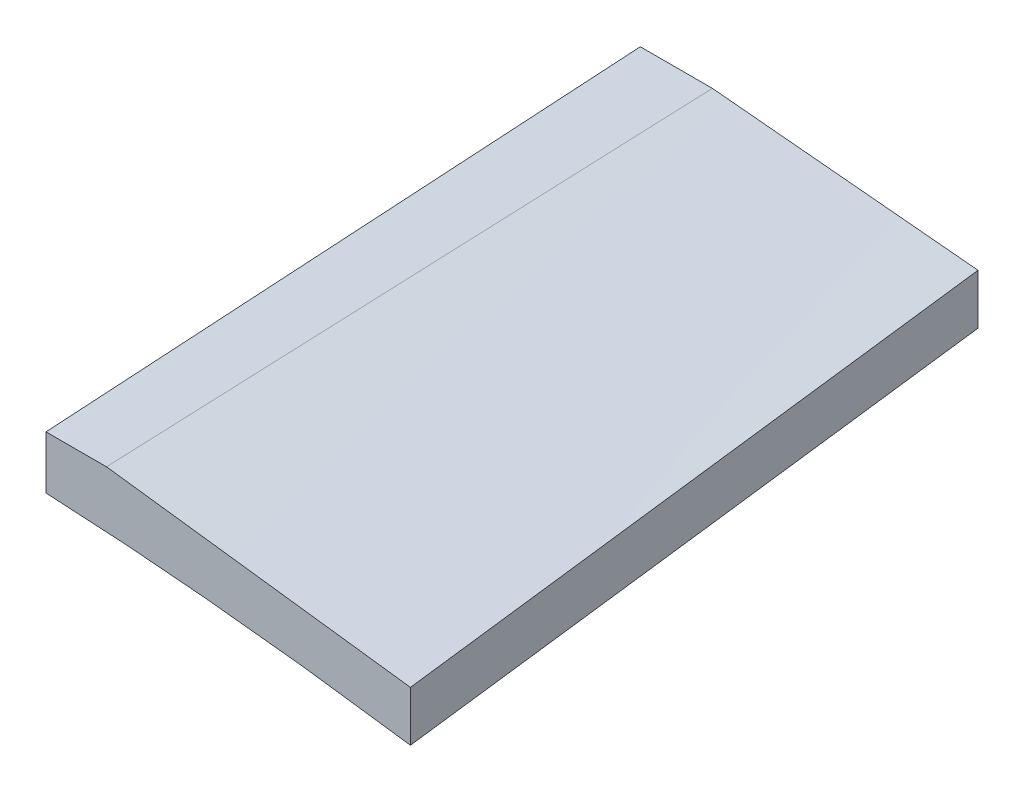
ISO-10303-21;
HEADER;
FILE_DESCRIPTION(('STEP AP214'),'2;1');
FILE_NAME('part.step','',(''),(''),'','','');
FILE_SCHEMA(('AUTOMOTIVE_DESIGN { 1 0 10303 214 1 1 1 1 }'));
ENDSEC;
DATA;
#1=APPLICATION_CONTEXT('core data for automotive mechanical design processes');
#2=APPLICATION_PROTOCOL_DEFINITION('international standard','automotive_design',2000,#1);
#3=PRODUCT_CONTEXT('',#1,'mechanical');
#4=PRODUCT('Part','Part','',(#3));
#5=PRODUCT_RELATED_PRODUCT_CATEGORY('part','',(#4));
#6=PRODUCT_DEFINITION_FORMATION('','',#4);
#7=PRODUCT_DEFINITION_CONTEXT('part definition',#1,'design');
#8=PRODUCT_DEFINITION('design','',#6,#7);
#9=PRODUCT_DEFINITION_SHAPE('','',#8);
#10=(LENGTH_UNIT() NAMED_UNIT(*) SI_UNIT(.MILLI.,.METRE.));
#11=(NAMED_UNIT(*) PLANE_ANGLE_UNIT() SI_UNIT($,.RADIAN.));
#12=(NAMED_UNIT(*) SI_UNIT($,.STERADIAN.) SOLID_ANGLE_UNIT());
#13=UNCERTAINTY_MEASURE_WITH_UNIT(LENGTH_MEASURE(1.E-05),#10,'distance_accuracy_value','');
#14=(GEOMETRIC_REPRESENTATION_CONTEXT(3) GLOBAL_UNCERTAINTY_ASSIGNED_CONTEXT((#13)) GLOBAL_UNIT_ASSIGNED_CONTEXT((#10,
#11,#12)) REPRESENTATION_CONTEXT('',''));
#15=CARTESIAN_POINT('',(0.,0.,0.));
#16=DIRECTION('',(0.,0.,1.));
#17=DIRECTION('',(1.,0.,0.));
#18=AXIS2_PLACEMENT_3D('',#15,#16,#17);
#19=CARTESIAN_POINT('',(122.012987748225,6.34998004884586,335.28));
#20=DIRECTION('',(1.,0.,0.));
#21=DIRECTION('',(0.,0.,-1.));
#22=AXIS2_PLACEMENT_3D('',#19,#20,#21);
#23=PLANE('',#22);
#24=CARTESIAN_POINT('',(122.012987753095,51.5903413603549,-91.4399999999999));
#25=CARTESIAN_POINT('',(122.012987749983,50.8127379259849,-79.5867202725594));
#26=CARTESIAN_POINT('',(122.012987748698,50.0353507213693,-67.7334263605867));
#27=CARTESIAN_POINT('',(122.012987747751,48.4809910908885,-44.0268113543124));
#28=CARTESIAN_POINT('',(122.01298774809,47.7040186650228,-32.1734902600109));
#29=CARTESIAN_POINT('',(122.01298774836,46.1504709095576,-8.46682204949769));
#30=CARTESIAN_POINT('',(122.012987748293,45.3738955799581,3.38652506671391));
#31=CARTESIAN_POINT('',(122.012987748157,43.8211244635701,27.0932441723444));
#32=CARTESIAN_POINT('',(122.01298774809,43.0449286767821,38.9466161617634));
#33=CARTESIAN_POINT('',(122.012987748225,42.268913885554,50.7999999999811));
#34=B_SPLINE_CURVE_WITH_KNOTS('',3,(#24,#25,#26,#27,#28,#29,#30,#31,#32,#33),.UNSPECIFIED.,.F.,
.F.,(4,2,2,2,4),(0.,35.6362759891527,71.272551938302,106.908827886564,142.545103874829),.UNSPECIFIED.);
#35=CARTESIAN_POINT('',(122.012985594409,51.5902087951168,-91.4399999999998));
#36=VERTEX_POINT('',#35);
#37=CARTESIAN_POINT('',(122.012987748225,42.268913885554,50.7999999999811));
#38=VERTEX_POINT('',#37);
#39=EDGE_CURVE('E113',#36,#38,#34,.T.);
#40=ORIENTED_EDGE('',*,*,#39,.T.);
#41=DIRECTION('',(0.,-1.,0.));
#42=VECTOR('',#41,1.);
#43=CARTESIAN_POINT('',(122.012987748225,6.34998004884586,50.8));
#44=LINE('',#43,#42);
#45=CARTESIAN_POINT('',(122.012987748225,54.9460232350274,50.7999999999811));
#46=VERTEX_POINT('',#45);
#47=EDGE_CURVE('E11',#46,#38,#44,.T.);
#48=ORIENTED_EDGE('',*,*,#47,.F.);
#49=CARTESIAN_POINT('',(122.012987748225,54.9460232350274,50.7999999999811));
#50=CARTESIAN_POINT('',(122.012987748225,55.9635309786544,34.1644219579198));
#51=CARTESIAN_POINT('',(122.012987748225,56.9813776547402,17.5288646435544));
#52=CARTESIAN_POINT('',(122.012987748225,59.0177944365331,-15.742205681728));
#53=CARTESIAN_POINT('',(122.012987748225,60.0363645422391,-32.3777186926452));
#54=CARTESIAN_POINT('',(122.012987748225,61.9215601213804,-63.1554894115923));
#55=CARTESIAN_POINT('',(122.012987748225,62.7880789795608,-77.2977536500892));
#56=CARTESIAN_POINT('',(122.012987748225,63.6548897190744,-91.4399999999999));
#57=B_SPLINE_CURVE_WITH_KNOTS('',3,(#49,#50,#51,#52,#53,#54,#55,#56),.UNSPECIFIED.,.F.,.F.,(4,2,
2,4),(0.,50.0000000934898,100.000000114269,142.506357681987),.UNSPECIFIED.);
#58=CARTESIAN_POINT('',(122.012987748225,63.6548897190744,-91.4399999999999));
#59=VERTEX_POINT('',#58);
#60=EDGE_CURVE('E116',#46,#59,#57,.T.);
#61=ORIENTED_EDGE('',*,*,#60,.T.);
#62=DIRECTION('',(0.,-1.,0.));
#63=VECTOR('',#62,1.);
#64=CARTESIAN_POINT('',(122.012987748225,51.6460530017887,-91.4399999999997));
#65=LINE('',#64,#63);
#66=EDGE_CURVE('E97',#59,#36,#65,.T.);
#67=ORIENTED_EDGE('',*,*,#66,.T.);
#68=EDGE_LOOP('',(#40,#48,#61,#67));
#69=FACE_BOUND('',#68,.T.);
#70=ADVANCED_FACE('F44',(#69),#23,.F.);
#71=CARTESIAN_POINT('',(0.,0.,50.8));
#72=DIRECTION('',(0.,0.,1.));
#73=DIRECTION('',(1.,0.,0.));
#74=AXIS2_PLACEMENT_3D('',#71,#72,#73);
#75=PLANE('',#74);
#76=CARTESIAN_POINT('',(209.230847337821,33.595842069036,50.8));
#77=CARTESIAN_POINT('',(208.025152317248,33.7723759248858,50.8));
#78=CARTESIAN_POINT('',(206.819182070088,33.9470314127565,50.8));
#79=CARTESIAN_POINT('',(204.406689974741,34.2924957503762,50.8));
#80=CARTESIAN_POINT('',(203.200168126187,34.4633045975705,50.8));
#81=CARTESIAN_POINT('',(200.786941644819,34.800933980048,50.8));
#82=CARTESIAN_POINT('',(199.580237180211,34.96775571681,50.8));
#83=CARTESIAN_POINT('',(197.166282190393,35.2973933779907,50.8));
#84=CARTESIAN_POINT('',(195.959031665217,35.4602093026612,50.8));
#85=CARTESIAN_POINT('',(192.337081572201,35.9422966200058,50.8));
#86=CARTESIAN_POINT('',(189.921541429177,36.2552975464865,50.8));
#87=CARTESIAN_POINT('',(186.296741727862,36.7108181799761,50.8));
#88=CARTESIAN_POINT('',(185.088355361681,36.8603131262002,50.8));
#89=CARTESIAN_POINT('',(182.670991607541,37.1544442927972,50.8));
#90=CARTESIAN_POINT('',(181.462014219506,37.2990805125503,50.8));
#91=CARTESIAN_POINT('',(177.834561667416,37.7254694276855,50.8));
#92=CARTESIAN_POINT('',(175.415200716581,37.9997483867404,50.8));
#93=CARTESIAN_POINT('',(171.784534444878,38.3953343071575,50.8));
#94=CARTESIAN_POINT('',(170.574085315804,38.5245531442786,50.8));
#95=CARTESIAN_POINT('',(168.152642442773,38.7777946571532,50.8));
#96=CARTESIAN_POINT('',(166.941648698677,38.9018173315685,50.8));
#97=CARTESIAN_POINT('',(164.519107052186,39.1447933959834,50.8));
#98=CARTESIAN_POINT('',(163.307559130601,39.2637465944752,50.8));
#99=CARTESIAN_POINT('',(160.883987043973,39.4966955240975,50.8));
#100=CARTESIAN_POINT('',(159.671962879002,39.610691255984,50.8));
#101=CARTESIAN_POINT('',(157.247386626677,39.8338159130427,50.8));
#102=CARTESIAN_POINT('',(156.034834509922,39.9429445186548,50.8));
#103=CARTESIAN_POINT('',(153.609304179194,40.1563627089267,50.8));
#104=CARTESIAN_POINT('',(152.3963259651,40.2606522922155,50.8));
#105=CARTESIAN_POINT('',(149.969808215908,40.4644591741015,50.8));
#106=CARTESIAN_POINT('',(148.756268627971,40.5639758433482,50.8));
#107=CARTESIAN_POINT('',(146.328808573915,40.7582519561394,50.8));
#108=CARTESIAN_POINT('',(145.11488810786,40.8530114004872,50.8));
#109=CARTESIAN_POINT('',(142.686404635555,41.0372500866874,50.8));
#110=CARTESIAN_POINT('',(141.471841549765,41.1267282823664,50.8));
#111=CARTESIAN_POINT('',(139.042302119273,41.299899718021,50.8));
#112=CARTESIAN_POINT('',(137.827325774478,41.3835929566902,50.8));
#113=CARTESIAN_POINT('',(135.396606916646,41.5448240876751,50.8));
#114=CARTESIAN_POINT('',(134.180864283447,41.6223601715288,50.8));
#115=CARTESIAN_POINT('',(131.748974807422,41.7707957864617,50.8));
#116=CARTESIAN_POINT('',(130.532827965172,41.8416953269315,50.8));
#117=CARTESIAN_POINT('',(126.882756849898,42.0438117710736,50.8));
#118=CARTESIAN_POINT('',(124.448241517671,42.1643767634276,50.8));
#119=CARTESIAN_POINT('',(122.012987748225,42.2689138855527,50.8));
#120=B_SPLINE_CURVE_WITH_KNOTS('',3,(#76,#77,#78,#79,#80,#81,#82,#83,#84,#85,#86,#87,#88,#89,
#90,#91,#92,#93,#94,#95,#96,#97,#98,#99,#100,#101,#102,#103,#104,#105,#106,#107,#108,#109,#110,
#111,#112,#113,#114,#115,#116,#117,#118,#119),.UNSPECIFIED.,.F.,.F.,(4,2,2,2,2,2,2,2,2,2,2,2,2,
2,2,2,2,2,2,2,2,4),(0.,3.65564947430247,7.31130137646595,10.9658374266024,14.6203732469968,
21.9274999239574,25.5802872569879,29.2330750559892,36.5375458333369,40.1895173027451,
43.8414897125591,47.4935999595117,51.1457096494075,54.7980587732716,58.4504089319146,
62.1032393683011,65.7560691879163,69.4096201922626,73.0631720217723,76.7177930232235,
80.3724088533061,87.6847658975797),.UNSPECIFIED.);
#121=CARTESIAN_POINT('',(209.230847337816,33.5958420690438,50.7999999999074));
#122=VERTEX_POINT('',#121);
#123=EDGE_CURVE('E112',#122,#38,#120,.T.);
#124=ORIENTED_EDGE('',*,*,#123,.F.);
#125=DIRECTION('',(0.,-1.,0.));
#126=VECTOR('',#125,1.);
#127=CARTESIAN_POINT('',(209.230847335755,9.36643436036436,50.8));
#128=LINE('',#127,#126);
#129=CARTESIAN_POINT('',(209.230847337816,45.5958420690438,50.7999999999074));
#130=VERTEX_POINT('',#129);
#131=EDGE_CURVE('E128',#130,#122,#128,.T.);
#132=ORIENTED_EDGE('',*,*,#131,.F.);
#133=CARTESIAN_POINT('',(136.489886899315,54.9460232350262,50.8));
#134=CARTESIAN_POINT('',(144.13434655408,53.9633982840046,50.8));
#135=CARTESIAN_POINT('',(151.778806208844,52.980773332983,50.8));
#136=CARTESIAN_POINT('',(167.724529442644,50.9310973298072,50.8));
#137=CARTESIAN_POINT('',(176.025793021679,49.8640462776529,50.8));
#138=CARTESIAN_POINT('',(192.62832017975,47.7299441733444,50.8));
#139=CARTESIAN_POINT('',(200.929583758785,46.6628931211902,50.8));
#140=CARTESIAN_POINT('',(209.230847337821,45.5958420690359,50.8));
#141=B_SPLINE_CURVE_WITH_KNOTS('',3,(#133,#134,#135,#136,#137,#138,#139,#140),.UNSPECIFIED.,.F.,
.F.,(4,2,2,4),(0.,23.1220638540164,48.2307510878943,73.3394383217721),.UNSPECIFIED.);
#142=CARTESIAN_POINT('',(136.489886899315,54.9460232350262,50.8));
#143=VERTEX_POINT('',#142);
#144=EDGE_CURVE('E161',#143,#130,#141,.T.);
#145=ORIENTED_EDGE('',*,*,#144,.F.);
#146=DIRECTION('',(-1.,0.,0.));
#147=VECTOR('',#146,1.);
#148=CARTESIAN_POINT('',(111.489886899315,54.9460232350262,50.8));
#149=LINE('',#148,#147);
#150=EDGE_CURVE('E169',#46,#143,#149,.F.);
#151=ORIENTED_EDGE('',*,*,#150,.F.);
#152=ORIENTED_EDGE('',*,*,#47,.T.);
#153=EDGE_LOOP('',(#124,#132,#145,#151,#152));
#154=FACE_BOUND('',#153,.T.);
#155=ADVANCED_FACE('F170',(#154),#75,.T.);
#156=CARTESIAN_POINT('',(130.956058059283,37.574856415899,335.28));
#157=CARTESIAN_POINT('',(133.722938387168,46.2481983373047,193.03830052474));
#158=CARTESIAN_POINT('',(136.489876885067,54.9368025875343,50.7978960975484));
#159=CARTESIAN_POINT('',(139.256928095494,63.6548897190744,-91.4399999999999));
#160=CARTESIAN_POINT('',(126.789391392616,37.5748564158991,335.28));
#161=CARTESIAN_POINT('',(129.556271720501,46.2481983373047,193.03830052474));
#162=CARTESIAN_POINT('',(132.3232102184,54.9368025875343,50.7978960975483));
#163=CARTESIAN_POINT('',(135.090261428827,63.6548897190744,-91.44));
#164=CARTESIAN_POINT('',(118.456058059283,37.574856415899,335.28));
#165=CARTESIAN_POINT('',(121.222938387168,46.2481983373047,193.03830052474));
#166=CARTESIAN_POINT('',(123.989876885067,54.9368025875344,50.7978960975478));
#167=CARTESIAN_POINT('',(126.756928095494,63.6548897190745,-91.4400000000005));
#168=CARTESIAN_POINT('',(105.956058059283,37.5748564158991,335.28));
#169=CARTESIAN_POINT('',(108.722938387168,46.2481983373046,193.038300524741));
#170=CARTESIAN_POINT('',(111.489876885067,54.9368025875342,50.7978960975486));
#171=CARTESIAN_POINT('',(114.256928095494,63.6548897190743,-91.4399999999992));
#172=CARTESIAN_POINT('',(93.4560580592829,37.574856415899,335.28));
#173=CARTESIAN_POINT('',(96.222938387168,46.2481983373047,193.03830052474));
#174=CARTESIAN_POINT('',(98.989876885067,54.9368025875343,50.7978960975481));
#175=CARTESIAN_POINT('',(101.756928095494,63.6548897190744,-91.4400000000002));
#176=CARTESIAN_POINT('',(85.1227247259497,37.574856415899,335.28));
#177=CARTESIAN_POINT('',(87.8896050538347,46.2481983373046,193.03830052474));
#178=CARTESIAN_POINT('',(90.6565435517336,54.9368025875343,50.7978960975484));
#179=CARTESIAN_POINT('',(93.4235947621608,63.6548897190744,-91.4399999999999));
#180=CARTESIAN_POINT('',(80.956058059283,37.5748564158991,335.28));
#181=CARTESIAN_POINT('',(83.722938387168,46.2481983373047,193.03830052474));
#182=CARTESIAN_POINT('',(86.489876885067,54.9368025875343,50.7978960975484));
#183=CARTESIAN_POINT('',(89.2569280954942,63.6548897190744,-91.4399999999999));
#184=B_SPLINE_SURFACE_WITH_KNOTS('',3,3,((#156,#157,#158,#159),(#160,#161,#162,#163),(#164,#165,
#166,#167),(#168,#169,#170,#171),(#172,#173,#174,#175),(#176,#177,#178,#179),(#180,#181,#182,
#183)),.UNSPECIFIED.,.F.,.F.,.F.,(4,1,1,1,4),(4,4),(0.19667758886926,0.224376205647247,
0.252074822425234,0.279773439203221,0.307472055981208),(0.,1.),.UNSPECIFIED.);
#185=CARTESIAN_POINT('',(130.956058059283,37.574856415899,335.28));
#186=CARTESIAN_POINT('',(133.722938387168,46.2481983373047,193.03830052474));
#187=CARTESIAN_POINT('',(136.489876885067,54.9368025875343,50.7978960975484));
#188=CARTESIAN_POINT('',(139.256928095494,63.6548897190744,-91.4399999999999));
#189=B_SPLINE_CURVE_WITH_KNOTS('',3,(#185,#186,#187,#188),.UNSPECIFIED.,.F.,.F.,(4,4),(0.,1.),.UNSPECIFIED.);
#190=CARTESIAN_POINT('',(139.256928095494,63.6548897190744,-91.4399999999999));
#191=VERTEX_POINT('',#190);
#192=EDGE_CURVE('E125',#143,#191,#189,.T.);
#193=CARTESIAN_POINT('',(139.256928095494,63.6548897190744,-91.4399999999999));
#194=CARTESIAN_POINT('',(135.090261428827,63.6548897190744,-91.44));
#195=CARTESIAN_POINT('',(126.756928095494,63.6548897190745,-91.4400000000005));
#196=CARTESIAN_POINT('',(114.256928095494,63.6548897190743,-91.4399999999992));
#197=CARTESIAN_POINT('',(101.756928095494,63.6548897190744,-91.4400000000002));
#198=CARTESIAN_POINT('',(93.4235947621608,63.6548897190744,-91.4399999999999));
#199=CARTESIAN_POINT('',(89.2569280954942,63.6548897190744,-91.4399999999999));
#200=B_SPLINE_CURVE_WITH_KNOTS('',3,(#193,#194,#195,#196,#197,#198,#199),.UNSPECIFIED.,.F.,.F.,
(4,1,1,1,4),(0.19667758886926,0.224376205647247,0.252074822425234,0.279773439203221,
0.307472055981208),.UNSPECIFIED.);
#201=EDGE_CURVE('E102',#191,#59,#200,.T.);
#202=ORIENTED_EDGE('',*,*,#60,.F.);
#203=ORIENTED_EDGE('',*,*,#150,.T.);
#204=ORIENTED_EDGE('',*,*,#192,.T.);
#205=ORIENTED_EDGE('',*,*,#201,.T.);
#206=EDGE_LOOP('',(#202,#203,#204,#205));
#207=FACE_BOUND('',#206,.T.);
#208=ADVANCED_FACE('F123',(#207),#184,.F.);
#209=CARTESIAN_POINT('',(111.477492972876,51.6460530017887,-91.4399999999997));
#210=DIRECTION('',(0.,0.,-1.));
#211=DIRECTION('',(1.,0.,0.));
#212=AXIS2_PLACEMENT_3D('',#209,#210,#211);
#213=PLANE('',#212);
#214=ORIENTED_EDGE('',*,*,#66,.F.);
#215=ORIENTED_EDGE('',*,*,#201,.F.);
#216=CARTESIAN_POINT('',(202.839777129521,57.7338764691475,-91.4399999999999));
#217=CARTESIAN_POINT('',(197.541206376685,58.2272942399747,-91.4399999999999));
#218=CARTESIAN_POINT('',(186.944064871014,59.2141297816292,-91.4399999999996));
#219=CARTESIAN_POINT('',(171.048352612508,60.694383094111,-91.4400000000009));
#220=CARTESIAN_POINT('',(155.152640354001,62.1746364065926,-91.4399999999991));
#221=CARTESIAN_POINT('',(144.55549884833,63.1614719482472,-91.4399999999999));
#222=CARTESIAN_POINT('',(139.256928095494,63.6548897190744,-91.4399999999999));
#223=B_SPLINE_CURVE_WITH_KNOTS('',3,(#216,#217,#218,#219,#220,#221,#222),.UNSPECIFIED.,.F.,.F.,
(4,1,1,1,4),(0.0265906721068675,0.0691124012974655,0.111634130488064,0.154155859678662,
0.19667758886926),.UNSPECIFIED.);
#224=CARTESIAN_POINT('',(202.839777129521,57.7338764691475,-91.4399999999999));
#225=VERTEX_POINT('',#224);
#226=EDGE_CURVE('E127',#225,#191,#223,.T.);
#227=ORIENTED_EDGE('',*,*,#226,.F.);
#228=CARTESIAN_POINT('',(202.839777129521,45.7338764691475,-91.4399999999997));
#229=DIRECTION('',(0.,1.,0.));
#230=VECTOR('',#229,1.);
#231=LINE('',#228,#230);
#232=CARTESIAN_POINT('',(202.839777129521,45.7338764691475,-91.4399999999999));
#233=VERTEX_POINT('',#232);
#234=EDGE_CURVE('E230',#233,#225,#231,.T.);
#235=ORIENTED_EDGE('',*,*,#234,.F.);
#236=CARTESIAN_POINT('',(24.9991434170329,31.0964008470047,-91.4399999999999));
#237=CARTESIAN_POINT('',(24.9991434170329,31.9847454271249,-91.4399999999999));
#238=CARTESIAN_POINT('',(25.7503176768857,33.8050798804101,-91.4399999999995));
#239=CARTESIAN_POINT('',(27.639772216348,35.8005902171344,-91.4400000000005));
#240=CARTESIAN_POINT('',(29.1705173067003,36.9980207293825,-91.4399999999997));
#241=CARTESIAN_POINT('',(30.3450357013417,37.7638508164184,-91.4399999999995));
#242=CARTESIAN_POINT('',(31.5628825203461,38.4646841877197,-91.4400000000003));
#243=CARTESIAN_POINT('',(32.8194198795603,39.1326380892775,-91.4399999999985));
#244=CARTESIAN_POINT('',(34.1087660162101,39.76211537415,-91.4400000000019));
#245=CARTESIAN_POINT('',(35.423753443141,40.3575744912294,-91.4399999999986));
#246=CARTESIAN_POINT('',(36.7523273727916,40.9175522446957,-91.4399999999994));
#247=CARTESIAN_POINT('',(38.5365484496361,41.620439414076,-91.4400000000014));
#248=CARTESIAN_POINT('',(40.7808179288063,42.4236899026778,-91.4399999999981));
#249=CARTESIAN_POINT('',(43.4998863356233,43.3024834322195,-91.4400000000012));
#250=CARTESIAN_POINT('',(46.2422110430595,44.1243377503001,-91.4399999999992));
#251=CARTESIAN_POINT('',(49.0044552878221,44.8839503138367,-91.4399999999999));
#252=CARTESIAN_POINT('',(51.7823749144814,45.579852219273,-91.4400000000001));
#253=CARTESIAN_POINT('',(54.5738920306224,46.2168613574358,-91.4399999999994));
#254=CARTESIAN_POINT('',(57.3771248806601,46.8012725525181,-91.4400000000006));
#255=CARTESIAN_POINT('',(60.1895182985876,47.3383437533655,-91.4399999999989));
#256=CARTESIAN_POINT('',(63.009968933455,47.8345333447187,-91.4400000000012));
#257=CARTESIAN_POINT('',(66.7768063122753,48.4457345663082,-91.4399999999991));
#258=CARTESIAN_POINT('',(71.5024082401206,49.1196825782396,-91.4400000000007));
#259=CARTESIAN_POINT('',(77.1867296544622,49.8002607677224,-91.439999999999));
#260=CARTESIAN_POINT('',(82.8854110833438,50.3635232660471,-91.4400000000006));
#261=CARTESIAN_POINT('',(88.5929506729966,50.8177231044828,-91.4399999999991));
#262=CARTESIAN_POINT('',(94.3079711235791,51.1697652740891,-91.4399999999997));
#263=CARTESIAN_POINT('',(100.028027305093,51.4230511844363,-91.4400000000007));
#264=CARTESIAN_POINT('',(105.751617096862,51.5835049453433,-91.439999999999));
#265=CARTESIAN_POINT('',(111.477378125771,51.6589739402079,-91.4400000000002));
#266=CARTESIAN_POINT('',(117.203856511302,51.6569311157104,-91.4399999999996));
#267=CARTESIAN_POINT('',(122.929922812333,51.5850406774286,-91.4400000000001));
#268=CARTESIAN_POINT('',(128.65378774678,51.4507617403976,-91.4399999999992));
#269=CARTESIAN_POINT('',(134.376572579236,51.2599111467022,-91.4400000000004));
#270=CARTESIAN_POINT('',(140.096075836652,51.0187994571294,-91.4399999999993));
#271=CARTESIAN_POINT('',(147.722715464536,50.6376937143126,-91.44));
#272=CARTESIAN_POINT('',(157.24570464898,50.066963000205,-91.44));
#273=CARTESIAN_POINT('',(168.667449255981,49.2246160795646,-91.4399999999997));
#274=CARTESIAN_POINT('',(180.072593521347,48.2132709896145,-91.4399999999999));
#275=CARTESIAN_POINT('',(191.464847585162,47.0481018399075,-91.4399999999997));
#276=CARTESIAN_POINT('',(199.049690584614,46.1853189884351,-91.4399999999999));
#277=CARTESIAN_POINT('',(202.839777129521,45.7338764691475,-91.4399999999999));
#278=B_SPLINE_CURVE_WITH_KNOTS('',3,(#236,#237,#238,#239,#240,#241,#242,#243,#244,#245,#246,
#247,#248,#249,#250,#251,#252,#253,#254,#255,#256,#257,#258,#259,#260,#261,#262,#263,#264,#265,
#266,#267,#268,#269,#270,#271,#272,#273,#274,#275,#276,#277),.UNSPECIFIED.,.F.,.F.,(4,1,1,1,1,1,
1,1,1,1,1,1,1,1,1,1,1,1,1,1,1,1,1,1,1,1,1,1,1,1,1,1,1,1,1,1,1,1,1,4),(0.548393358469235,
0.555449712243154,0.562506066017072,0.566034242904031,0.56956241979099,0.573090596677949,
0.576618773564908,0.580146950451867,0.583675127338826,0.587203304225785,0.590731481112744,
0.597787834886663,0.604844188660581,0.611900542434499,0.618956896208417,0.626013249982335,
0.633069603756254,0.640125957530172,0.64718231130409,0.654238665078008,0.661295018851926,
0.675407726399763,0.689520433947599,0.703633141495436,0.717745849043272,0.731858556591108,
0.745971264138945,0.760083971686781,0.774196679234618,0.788309386782454,0.80242209433029,
0.816534801878127,0.830647509425963,0.8447602169738,0.858872924521636,0.887098339617309,
0.915323754712982,0.943549169808654,0.971774584904327,1.),.UNSPECIFIED.);
#279=EDGE_CURVE('E106',#36,#233,#278,.T.);
#280=ORIENTED_EDGE('',*,*,#279,.F.);
#281=EDGE_LOOP('',(#214,#215,#227,#235,#280));
#282=FACE_BOUND('',#281,.T.);
#283=ADVANCED_FACE('F99',(#282),#213,.T.);
#284=CARTESIAN_POINT('',(9.29077044004429E-07,6.34998004884775,335.28));
#285=CARTESIAN_POINT('',(8.33297207421032,14.5787844685806,193.03830052474));
#286=CARTESIAN_POINT('',(16.6660013893575,22.8228512171374,50.7978960975484));
#287=CARTESIAN_POINT('',(24.9991434170329,31.0964008470047,-91.4399999999999));
#288=CARTESIAN_POINT('',(9.29077600369592E-07,7.45438325082316,335.28));
#289=CARTESIAN_POINT('',(8.33297207421069,15.6111681299376,193.03830052474));
#290=CARTESIAN_POINT('',(16.6660013893577,23.783215337876,50.7978960975484));
#291=CARTESIAN_POINT('',(24.9991434170329,31.9847454271249,-91.4399999999999));
#292=CARTESIAN_POINT('',(0.969916519496457,9.6613167038059,335.28));
#293=CARTESIAN_POINT('',(9.22997388777417,17.6892352496878,193.038300524741));
#294=CARTESIAN_POINT('',(17.4900894260658,25.7324161243937,50.7978960975486));
#295=CARTESIAN_POINT('',(25.7503176768857,33.8050798804101,-91.4399999999995));
#296=CARTESIAN_POINT('',(3.44848156516794,12.0366302116868,335.28));
#297=CARTESIAN_POINT('',(11.5121687647093,19.9379477005165,193.03830052474));
#298=CARTESIAN_POINT('',(19.5759141342645,27.8545275181702,50.7978960975477));
#299=CARTESIAN_POINT('',(27.639772216348,35.8005902171344,-91.4400000000005));
#300=CARTESIAN_POINT('',(5.45941166538086,13.4428022435293,335.28));
#301=CARTESIAN_POINT('',(13.3630371949687,21.2745392258276,193.038300524741));
#302=CARTESIAN_POINT('',(21.2667208945703,29.1215385369498,50.7978960975484));
#303=CARTESIAN_POINT('',(29.1705173067003,36.9980207293825,-91.4399999999997));
#304=CARTESIAN_POINT('',(6.98203766683405,14.316970710559,335.28));
#305=CARTESIAN_POINT('',(14.7696273274846,22.112594899526,193.03830052474));
#306=CARTESIAN_POINT('',(22.557275158149,29.923481417317,50.7978960975484));
#307=CARTESIAN_POINT('',(30.3450357013417,37.7638508164184,-91.4399999999995));
#308=CARTESIAN_POINT('',(8.54472942418297,15.0888371575498,335.28));
#309=CARTESIAN_POINT('',(16.217370772052,22.8607836546203,193.038300524741));
#310=CARTESIAN_POINT('',(23.8900702899349,30.6479924805147,50.7978960975481));
#311=CARTESIAN_POINT('',(31.5628825203461,38.4646841877197,-91.4400000000003));
#312=CARTESIAN_POINT('',(10.1582127248828,15.8184229079955,335.28));
#313=CARTESIAN_POINT('',(17.7118720922566,23.5698254554367,193.038300524741));
#314=CARTESIAN_POINT('',(25.2655896296443,31.3364903317018,50.7978960975493));
#315=CARTESIAN_POINT('',(32.8194198795603,39.1326380892775,-91.4399999999985));
#316=CARTESIAN_POINT('',(11.8098506399446,16.4960217707987,335.28));
#317=CARTESIAN_POINT('',(19.2427460811811,24.2313837922629,193.03830052474));
#318=CARTESIAN_POINT('',(26.6756996924314,31.9820081425512,50.7978960975468));
#319=CARTESIAN_POINT('',(34.1087660162101,39.76211537415,-91.4400000000019));
#320=CARTESIAN_POINT('',(13.4900691645311,17.1289319071832,335.28));
#321=CARTESIAN_POINT('',(20.801220906549,24.8518102555458,193.038300524741));
#322=CARTESIAN_POINT('',(28.1124308185809,32.5899509327323,50.7978960975493));
#323=CARTESIAN_POINT('',(35.423753443141,40.3575744912294,-91.4399999999986));
#324=CARTESIAN_POINT('',(15.1903900958544,17.7169000721208,335.28));
#325=CARTESIAN_POINT('',(22.3776261706481,25.4304482833263,193.03830052474));
#326=CARTESIAN_POINT('',(29.5649204154557,33.1592588233557,50.7978960975485));
#327=CARTESIAN_POINT('',(36.7523273727916,40.9175522446957,-91.4399999999994));
#328=CARTESIAN_POINT('',(17.465921328655,18.443907318319,335.28));
#329=CARTESIAN_POINT('',(24.4893873514633,26.1494155039185,193.03830052474));
#330=CARTESIAN_POINT('',(31.5129115442856,33.870186018342,50.7978960975473));
#331=CARTESIAN_POINT('',(38.5365484496361,41.620439414076,-91.4400000000014));
#332=CARTESIAN_POINT('',(20.3261253650035,19.2567063001384,335.28));
#333=CARTESIAN_POINT('',(27.1442798687524,26.9590316546654,193.038300524741));
#334=CARTESIAN_POINT('',(33.9624925425152,34.6766193380163,50.7978960975496));
#335=CARTESIAN_POINT('',(40.7808179288063,42.4236899026778,-91.4399999999981));
#336=CARTESIAN_POINT('',(23.7782685903277,20.118367205322,335.28));
#337=CARTESIAN_POINT('',(30.3520648212409,27.826403434635,193.03830052474));
#338=CARTESIAN_POINT('',(36.9259192221679,35.549701992772,50.7978960975475));
#339=CARTESIAN_POINT('',(43.4998863356233,43.3024834322195,-91.4400000000012));
#340=CARTESIAN_POINT('',(27.2569743923509,20.9064140542042,335.28));
#341=CARTESIAN_POINT('',(33.5853102584017,28.6257194399167,193.03830052474));
#342=CARTESIAN_POINT('',(39.9137042944664,36.3602871544532,50.7978960975486));
#343=CARTESIAN_POINT('',(46.2422110430595,44.1243377503001,-91.4399999999992));
#344=CARTESIAN_POINT('',(30.7542530905361,21.6165466303187,335.280000000001));
#345=CARTESIAN_POINT('',(36.8375774721128,29.3523453451718,193.038300524741));
#346=CARTESIAN_POINT('',(42.9209600237033,37.103406388849,50.7978960975486));
#347=CARTESIAN_POINT('',(49.0044552878221,44.8839503138367,-91.4399999999999));
#348=CARTESIAN_POINT('',(34.2664636940487,22.2460759079554,335.279999999999));
#349=CARTESIAN_POINT('',(40.1050244166742,30.0039988320751,193.03830052474));
#350=CARTESIAN_POINT('',(45.9436433093136,37.7771840850187,50.7978960975478));
#351=CARTESIAN_POINT('',(51.7823749144814,45.579852219273,-91.4400000000001));
#352=CARTESIAN_POINT('',(37.7902260736038,22.8004936568621,335.280000000001));
#353=CARTESIAN_POINT('',(43.384705041758,30.5859470440672,193.038300524741));
#354=CARTESIAN_POINT('',(48.979242179926,38.3866627600962,50.7978960975488));
#355=CARTESIAN_POINT('',(54.5738920306224,46.2168613574358,-91.4399999999994));
#356=CARTESIAN_POINT('',(41.3242497765985,23.2878811261495,335.28));
#357=CARTESIAN_POINT('',(46.675131793767,31.1056757552862,193.03830052474));
#358=CARTESIAN_POINT('',(52.0260719809494,38.9387327132469,50.7978960975476));
#359=CARTESIAN_POINT('',(57.3771248806601,46.8012725525181,-91.4400000000006));
#360=CARTESIAN_POINT('',(44.8658239828752,23.7149223381359,335.28));
#361=CARTESIAN_POINT('',(49.9736457372606,31.5693936302263,193.038300524741));
#362=CARTESIAN_POINT('',(55.0815256616599,39.4391272511406,50.797896097549));
#363=CARTESIAN_POINT('',(60.1895182985876,47.3383437533655,-91.4399999999989));
#364=CARTESIAN_POINT('',(48.4136829142244,24.0896238833925,335.28));
#365=CARTESIAN_POINT('',(53.2790352364492,31.9845911908484,193.03830052474));
#366=CARTESIAN_POINT('',(58.144445728688,39.8948208271283,50.7978960975474));
#367=CARTESIAN_POINT('',(63.009968933455,47.8345333447187,-91.4400000000012));
#368=CARTESIAN_POINT('',(53.1486242463732,24.5260190039242,335.28));
#369=CARTESIAN_POINT('',(57.6912752508218,32.4792550117327,193.038300524741));
#370=CARTESIAN_POINT('',(62.2339844252844,40.4477533483652,50.7978960975488));
#371=CARTESIAN_POINT('',(66.7768063122753,48.4457345663082,-91.4399999999991));
#372=CARTESIAN_POINT('',(59.0789436792651,24.9574757661192,335.28));
#373=CARTESIAN_POINT('',(63.2200221820315,32.9915421905065,193.03830052474));
#374=CARTESIAN_POINT('',(67.3611588548119,41.0408709437178,50.7978960975476));
#375=CARTESIAN_POINT('',(71.5024082401206,49.1196825782396,-91.4400000000007));
#376=CARTESIAN_POINT('',(66.2030814892412,25.3140522243183,335.28));
#377=CARTESIAN_POINT('',(69.8642211934628,33.4561192258002,193.038300524741));
#378=CARTESIAN_POINT('',(73.5254190676983,41.613448556106,50.7978960975488));
#379=CARTESIAN_POINT('',(77.1867296544622,49.8002607677224,-91.439999999999));
#380=CARTESIAN_POINT('',(73.3339674682549,25.523312736422,335.280000000001));
#381=CARTESIAN_POINT('',(76.5177056557658,33.7833803999775,193.038300524741));
#382=CARTESIAN_POINT('',(79.7015020132907,42.0587103923571,50.7978960975479));
#383=CARTESIAN_POINT('',(82.8854110833438,50.3635232660471,-91.4400000000006));
#384=CARTESIAN_POINT('',(80.4669900342226,25.5957976291351,335.279999999999));
#385=CARTESIAN_POINT('',(83.1755672296286,33.9831036079315,193.03830052474));
#386=CARTESIAN_POINT('',(85.8842025950485,42.3856719155519,50.7978960975486));
#387=CARTESIAN_POINT('',(88.5929506729966,50.8177231044828,-91.4399999999991));
#388=CARTESIAN_POINT('',(87.6002131526684,25.5406730290278,335.280000000001));
#389=CARTESIAN_POINT('',(89.8360561254533,34.0637012643954,193.038300524741));
#390=CARTESIAN_POINT('',(92.071957268252,42.6019918285869,50.7978960975485));
#391=CARTESIAN_POINT('',(94.3079711235791,51.1697652740891,-91.4399999999997));
#392=CARTESIAN_POINT('',(94.731344048156,25.3623320865792,335.28));
#393=CARTESIAN_POINT('',(96.4968287829496,34.0292359395454,193.03830052474));
#394=CARTESIAN_POINT('',(98.262371687757,42.7114021213355,50.7978960975476));
#395=CARTESIAN_POINT('',(100.028027305093,51.4230511844363,-91.4400000000007));
#396=CARTESIAN_POINT('',(101.858719846003,25.0679177013017,335.28));
#397=CARTESIAN_POINT('',(103.156275912104,33.8864442696627,193.038300524741));
#398=CARTESIAN_POINT('',(104.453890148219,42.7202331668477,50.797896097549));
#399=CARTESIAN_POINT('',(105.751617096862,51.5835049453433,-91.439999999999));
#400=CARTESIAN_POINT('',(108.98145520224,24.6671471282029,335.28));
#401=CARTESIAN_POINT('',(109.813353159231,33.6444202192184,193.03830052474));
#402=CARTESIAN_POINT('',(110.645309286237,42.6369556390579,50.797896097548));
#403=CARTESIAN_POINT('',(111.477378125771,51.6589739402079,-91.4400000000002));
#404=CARTESIAN_POINT('',(116.098371799005,24.1694505600281,335.28));
#405=CARTESIAN_POINT('',(116.466790352252,33.3119415656027,193.038300524741));
#406=CARTESIAN_POINT('',(116.835267075513,42.4696949000013,50.7978960975485));
#407=CARTESIAN_POINT('',(117.203856511302,51.6569311157104,-91.4399999999996));
#408=CARTESIAN_POINT('',(123.208750062991,23.5842845444573,335.28));
#409=CARTESIAN_POINT('',(123.115731295253,32.8978674091282,193.03830052474));
#410=CARTESIAN_POINT('',(123.022770697529,42.2267126026231,50.7978960975479));
#411=CARTESIAN_POINT('',(122.929922812333,51.5850406774286,-91.4400000000001));
#412=CARTESIAN_POINT('',(130.310988961638,22.921250348438,335.280000000001));
#413=CARTESIAN_POINT('',(129.758512205833,32.411084966105,193.038300524741));
#414=CARTESIAN_POINT('',(129.206093620042,41.9161819125961,50.7978960975489));
#415=CARTESIAN_POINT('',(128.65378774678,51.4507617403976,-91.4399999999992));
#416=CARTESIAN_POINT('',(137.406778455928,22.1873993770708,335.28));
#417=CARTESIAN_POINT('',(136.396633479512,31.8582341206284,193.03830052474));
#418=CARTESIAN_POINT('',(135.38654667311,41.54433119301,50.7978960975478));
#419=CARTESIAN_POINT('',(134.376572579236,51.2599111467022,-91.4400000000004));
#420=CARTESIAN_POINT('',(144.494202314858,21.3909417632401,335.28));
#421=CARTESIAN_POINT('',(143.028083804604,31.2468918148837,193.038300524741));
#422=CARTESIAN_POINT('',(141.562023464364,41.1181041953513,50.7978960975488));
#423=CARTESIAN_POINT('',(140.096075836652,51.0187994571294,-91.4399999999993));
#424=CARTESIAN_POINT('',(153.939247988962,20.2535758150893,335.279999999999));
#425=CARTESIAN_POINT('',(151.866994129968,30.3616126018442,193.03830052474));
#426=CARTESIAN_POINT('',(149.794798440988,40.4849117174231,50.797896097548));
#427=CARTESIAN_POINT('',(147.722715464536,50.6376937143126,-91.44));
#428=CARTESIAN_POINT('',(165.724997703164,18.7151343960646,335.280000000001));
#429=CARTESIAN_POINT('',(162.898490334251,29.1457414177919,193.038300524741));
#430=CARTESIAN_POINT('',(160.072041135351,39.5916107683432,50.7978960975484));
#431=CARTESIAN_POINT('',(157.24570464898,50.066963000205,-91.44));
#432=CARTESIAN_POINT('',(179.846765687905,16.6757724994209,335.28));
#433=CARTESIAN_POINT('',(176.120250526412,27.5053845131493,193.03830052474));
#434=CARTESIAN_POINT('',(172.393793534932,38.3502588557017,50.7978960975483));
#435=CARTESIAN_POINT('',(168.667449255981,49.2246160795646,-91.4399999999997));
#436=CARTESIAN_POINT('',(193.933550227643,14.4286098676329,335.28));
#437=CARTESIAN_POINT('',(189.313154974693,25.670161061974,193.038300524741));
#438=CARTESIAN_POINT('',(184.692817891756,36.926974585139,50.7978960975484));
#439=CARTESIAN_POINT('',(180.072593521347,48.2132709896145,-91.4399999999999));
#440=CARTESIAN_POINT('',(207.990516041457,11.9899167572326,335.28));
#441=CARTESIAN_POINT('',(202.481883538507,23.6559759384714,193.03830052474));
#442=CARTESIAN_POINT('',(196.97330920557,35.3372974485342,50.7978960975483));
#443=CARTESIAN_POINT('',(191.464847585162,47.0481018399075,-91.4399999999997));
#444=CARTESIAN_POINT('',(217.341938436305,10.2573401873864,335.28));
#445=CARTESIAN_POINT('',(211.244446134889,22.2133306080831,193.038300524741));
#446=CARTESIAN_POINT('',(205.147012003487,34.1845833576038,50.7978960975484));
#447=CARTESIAN_POINT('',(199.049690584614,46.1853189884351,-91.4399999999999));
#448=CARTESIAN_POINT('',(222.012987748225,9.36643436036436,335.28));
#449=CARTESIAN_POINT('',(215.621841191138,21.4689125503059,193.03830052474));
#450=CARTESIAN_POINT('',(209.230752804065,33.5866530690714,50.7978960975484));
#451=CARTESIAN_POINT('',(202.839777129521,45.7338764691475,-91.4399999999999));
#452=B_SPLINE_SURFACE_WITH_KNOTS('',3,3,((#284,#285,#286,#287),(#288,#289,#290,#291),(#292,#293,
#294,#295),(#296,#297,#298,#299),(#300,#301,#302,#303),(#304,#305,#306,#307),(#308,#309,#310,
#311),(#312,#313,#314,#315),(#316,#317,#318,#319),(#320,#321,#322,#323),(#324,#325,#326,#327),
(#328,#329,#330,#331),(#332,#333,#334,#335),(#336,#337,#338,#339),(#340,#341,#342,#343),(#344,
#345,#346,#347),(#348,#349,#350,#351),(#352,#353,#354,#355),(#356,#357,#358,#359),(#360,#361,
#362,#363),(#364,#365,#366,#367),(#368,#369,#370,#371),(#372,#373,#374,#375),(#376,#377,#378,
#379),(#380,#381,#382,#383),(#384,#385,#386,#387),(#388,#389,#390,#391),(#392,#393,#394,#395),
(#396,#397,#398,#399),(#400,#401,#402,#403),(#404,#405,#406,#407),(#408,#409,#410,#411),(#412,
#413,#414,#415),(#416,#417,#418,#419),(#420,#421,#422,#423),(#424,#425,#426,#427),(#428,#429,
#430,#431),(#432,#433,#434,#435),(#436,#437,#438,#439),(#440,#441,#442,#443),(#444,#445,#446,
#447),(#448,#449,#450,#451)),.UNSPECIFIED.,.F.,.F.,.F.,(4,1,1,1,1,1,1,1,1,1,1,1,1,1,1,1,1,1,1,1,
1,1,1,1,1,1,1,1,1,1,1,1,1,1,1,1,1,1,1,4),(4,4),(0.548393358469235,0.555449712243154,
0.562506066017072,0.566034242904031,0.56956241979099,0.573090596677949,0.576618773564908,
0.580146950451867,0.583675127338826,0.587203304225785,0.590731481112744,0.597787834886663,
0.604844188660581,0.611900542434499,0.618956896208417,0.626013249982335,0.633069603756254,
0.640125957530172,0.64718231130409,0.654238665078008,0.661295018851926,0.675407726399763,
0.689520433947599,0.703633141495436,0.717745849043272,0.731858556591108,0.745971264138945,
0.760083971686781,0.774196679234618,0.788309386782454,0.80242209433029,0.816534801878127,
0.830647509425963,0.8447602169738,0.858872924521636,0.887098339617309,0.915323754712982,
0.943549169808654,0.971774584904327,1.),(0.,1.),.UNSPECIFIED.);
#453=CARTESIAN_POINT('',(222.012987748225,9.36643436036436,335.28));
#454=CARTESIAN_POINT('',(215.621841191138,21.4689125503059,193.03830052474));
#455=CARTESIAN_POINT('',(209.230752804065,33.5866530690714,50.7978960975484));
#456=CARTESIAN_POINT('',(202.839777129521,45.7338764691475,-91.4399999999999));
#457=B_SPLINE_CURVE_WITH_KNOTS('',3,(#453,#454,#455,#456),.UNSPECIFIED.,.F.,.F.,(4,4),(0.,1.),.UNSPECIFIED.);
#458=EDGE_CURVE('E189',#122,#233,#457,.T.);
#459=ORIENTED_EDGE('',*,*,#458,.F.);
#460=ORIENTED_EDGE('',*,*,#123,.T.);
#461=ORIENTED_EDGE('',*,*,#39,.F.);
#462=ORIENTED_EDGE('',*,*,#279,.T.);
#463=EDGE_LOOP('',(#459,#460,#461,#462));
#464=FACE_BOUND('',#463,.T.);
#465=ADVANCED_FACE('F46',(#464),#452,.F.);
#466=CARTESIAN_POINT('',(222.012987748225,21.3664343603644,335.28));
#467=CARTESIAN_POINT('',(215.621841191138,33.4689125503059,193.03830052474));
#468=CARTESIAN_POINT('',(209.230752804065,45.5866530690714,50.7978960975484));
#469=CARTESIAN_POINT('',(202.839777129521,57.7338764691475,-91.4399999999999));
#470=CARTESIAN_POINT('',(214.424910274146,22.7171361983256,335.28));
#471=CARTESIAN_POINT('',(208.796932624141,34.5338530325558,193.03830052474));
#472=CARTESIAN_POINT('',(203.169013144149,46.36583219561,50.7978960975484));
#473=CARTESIAN_POINT('',(197.541206376685,58.2272942399747,-91.4399999999999));
#474=CARTESIAN_POINT('',(199.24875532599,25.418539874248,335.28));
#475=CARTESIAN_POINT('',(195.147115490146,36.6637339970556,193.03830052474));
#476=CARTESIAN_POINT('',(191.045533824316,47.9241904486871,50.7978960975484));
#477=CARTESIAN_POINT('',(186.944064871014,59.2141297816292,-91.4399999999996));
#478=CARTESIAN_POINT('',(176.484522903754,29.4706453881317,335.28));
#479=CARTESIAN_POINT('',(174.672389789153,39.8585554438053,193.03830052474));
#480=CARTESIAN_POINT('',(172.860314844566,50.2617278283029,50.7978960975477));
#481=CARTESIAN_POINT('',(171.048352612508,60.694383094111,-91.4400000000009));
#482=CARTESIAN_POINT('',(153.720290481519,33.5227509020154,335.28));
#483=CARTESIAN_POINT('',(154.197664088161,43.053376890555,193.03830052474));
#484=CARTESIAN_POINT('',(154.675095864817,52.5992652079185,50.7978960975487));
#485=CARTESIAN_POINT('',(155.152640354001,62.1746364065926,-91.4399999999991));
#486=CARTESIAN_POINT('',(138.544135533361,36.2241545779378,335.28));
#487=CARTESIAN_POINT('',(140.547846954166,45.1832578550548,193.03830052474));
#488=CARTESIAN_POINT('',(142.551616544983,54.1576234609957,50.7978960975484));
#489=CARTESIAN_POINT('',(144.55549884833,63.1614719482472,-91.4399999999999));
#490=CARTESIAN_POINT('',(130.956058059283,37.574856415899,335.28));
#491=CARTESIAN_POINT('',(133.722938387168,46.2481983373047,193.03830052474));
#492=CARTESIAN_POINT('',(136.489876885067,54.9368025875343,50.7978960975484));
#493=CARTESIAN_POINT('',(139.256928095494,63.6548897190744,-91.4399999999999));
#494=B_SPLINE_SURFACE_WITH_KNOTS('',3,3,((#466,#467,#468,#469),(#470,#471,#472,#473),(#474,#475,
#476,#477),(#478,#479,#480,#481),(#482,#483,#484,#485),(#486,#487,#488,#489),(#490,#491,#492,
#493)),.UNSPECIFIED.,.F.,.F.,.F.,(4,1,1,1,4),(4,4),(0.0265906721068675,0.0691124012974655,
0.111634130488064,0.154155859678662,0.19667758886926),(0.,1.),.UNSPECIFIED.);
#495=CARTESIAN_POINT('',(222.012987748225,21.3664343603644,335.28));
#496=CARTESIAN_POINT('',(215.621841191138,33.4689125503059,193.03830052474));
#497=CARTESIAN_POINT('',(209.230752804065,45.5866530690714,50.7978960975484));
#498=CARTESIAN_POINT('',(202.839777129521,57.7338764691475,-91.4399999999999));
#499=B_SPLINE_CURVE_WITH_KNOTS('',3,(#495,#496,#497,#498),.UNSPECIFIED.,.F.,.F.,(4,4),(0.,1.),.UNSPECIFIED.);
#500=EDGE_CURVE('E63',#130,#225,#499,.T.);
#501=ORIENTED_EDGE('',*,*,#192,.F.);
#502=ORIENTED_EDGE('',*,*,#144,.T.);
#503=ORIENTED_EDGE('',*,*,#500,.T.);
#504=ORIENTED_EDGE('',*,*,#226,.T.);
#505=EDGE_LOOP('',(#501,#502,#503,#504));
#506=FACE_BOUND('',#505,.T.);
#507=ADVANCED_FACE('F138',(#506),#494,.F.);
#508=CARTESIAN_POINT('',(222.012987748225,9.36643436036436,335.28));
#509=DIRECTION('',(0.998992101682105,0.,-0.0448863094581294));
#510=DIRECTION('',(0.,1.,0.));
#511=AXIS2_PLACEMENT_3D('',#508,#509,#510);
#512=PLANE('',#511);
#513=ORIENTED_EDGE('',*,*,#500,.F.);
#514=ORIENTED_EDGE('',*,*,#131,.T.);
#515=ORIENTED_EDGE('',*,*,#458,.T.);
#516=ORIENTED_EDGE('',*,*,#234,.T.);
#517=EDGE_LOOP('',(#513,#514,#515,#516));
#518=FACE_BOUND('',#517,.T.);
#519=ADVANCED_FACE('F149',(#518),#512,.T.);
#520=CLOSED_SHELL('',(#70,#155,#208,#283,#465,#507,#519));
#521=MANIFOLD_SOLID_BREP('B2',#520);
#522=ADVANCED_BREP_SHAPE_REPRESENTATION('',(#18,#521),#14);
#523=SHAPE_DEFINITION_REPRESENTATION(#9,#522);
ENDSEC;
END-ISO-10303-21;
